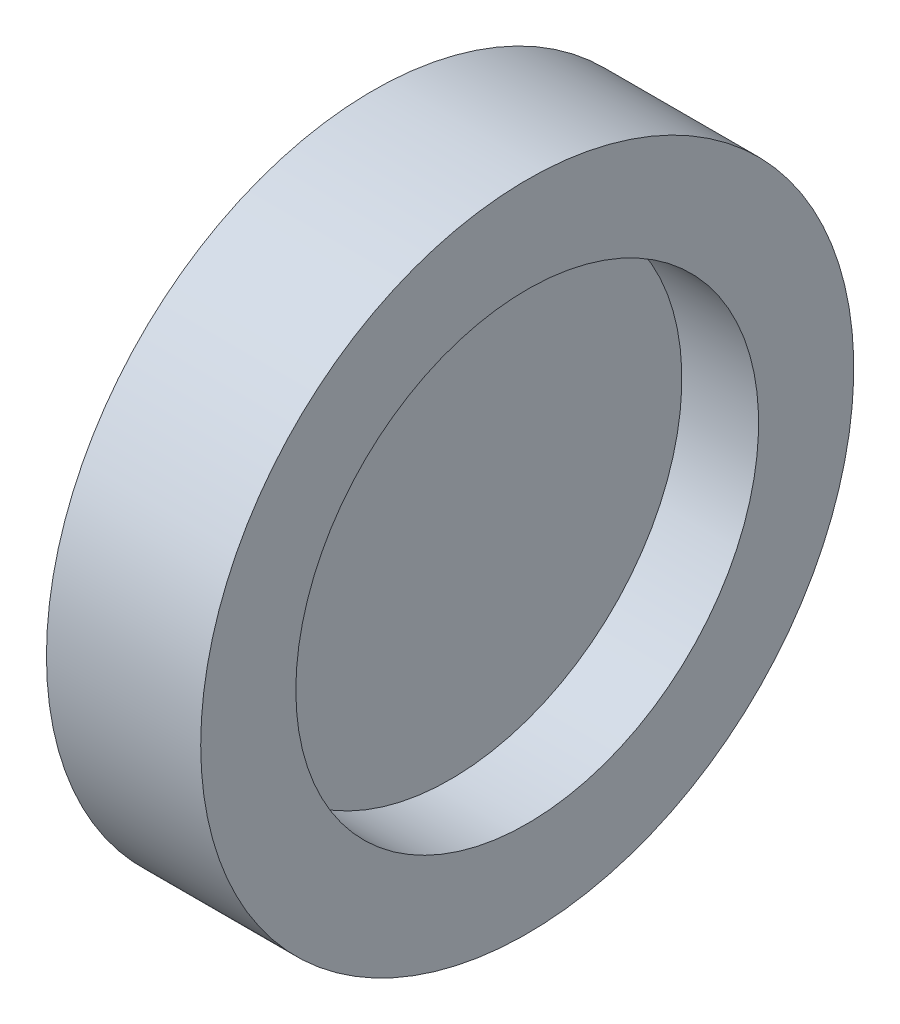
ISO-10303-21;
HEADER;
FILE_DESCRIPTION(('STEP AP214'),'2;1');
FILE_NAME('part.step','',(''),(''),'','','');
FILE_SCHEMA(('AUTOMOTIVE_DESIGN { 1 0 10303 214 1 1 1 1 }'));
ENDSEC;
DATA;
#1=APPLICATION_CONTEXT('core data for automotive mechanical design processes');
#2=APPLICATION_PROTOCOL_DEFINITION('international standard','automotive_design',2000,#1);
#3=PRODUCT_CONTEXT('',#1,'mechanical');
#4=PRODUCT('Part','Part','',(#3));
#5=PRODUCT_RELATED_PRODUCT_CATEGORY('part','',(#4));
#6=PRODUCT_DEFINITION_FORMATION('','',#4);
#7=PRODUCT_DEFINITION_CONTEXT('part definition',#1,'design');
#8=PRODUCT_DEFINITION('design','',#6,#7);
#9=PRODUCT_DEFINITION_SHAPE('','',#8);
#10=(LENGTH_UNIT() NAMED_UNIT(*) SI_UNIT(.MILLI.,.METRE.));
#11=(NAMED_UNIT(*) PLANE_ANGLE_UNIT() SI_UNIT($,.RADIAN.));
#12=(NAMED_UNIT(*) SI_UNIT($,.STERADIAN.) SOLID_ANGLE_UNIT());
#13=UNCERTAINTY_MEASURE_WITH_UNIT(LENGTH_MEASURE(1.E-05),#10,'distance_accuracy_value','');
#14=(GEOMETRIC_REPRESENTATION_CONTEXT(3) GLOBAL_UNCERTAINTY_ASSIGNED_CONTEXT((#13)) GLOBAL_UNIT_ASSIGNED_CONTEXT((#10,
#11,#12)) REPRESENTATION_CONTEXT('',''));
#15=CARTESIAN_POINT('',(0.,0.,0.));
#16=DIRECTION('',(0.,0.,1.));
#17=DIRECTION('',(1.,0.,0.));
#18=AXIS2_PLACEMENT_3D('',#15,#16,#17);
#19=CARTESIAN_POINT('',(0.0135000000000005,9.,0.));
#20=DIRECTION('',(-1.,0.,0.));
#21=DIRECTION('',(0.,0.,1.));
#22=AXIS2_PLACEMENT_3D('',#19,#20,#21);
#23=PLANE('',#22);
#24=CARTESIAN_POINT('',(0.0135000000000011,0.,0.));
#25=DIRECTION('',(-1.,0.,0.));
#26=DIRECTION('',(0.,0.,1.));
#27=AXIS2_PLACEMENT_3D('',#24,#25,#26);
#28=CIRCLE('',#27,9.);
#29=CARTESIAN_POINT('',(0.0135000000000011,0.,9.));
#30=VERTEX_POINT('',#29);
#31=EDGE_CURVE('E10',#30,#30,#28,.T.);
#32=ORIENTED_EDGE('',*,*,#31,.F.);
#33=EDGE_LOOP('',(#32));
#34=FACE_BOUND('',#33,.T.);
#35=ADVANCED_FACE('F37',(#34),#23,.F.);
#36=CARTESIAN_POINT('',(-1.61421241885762,0.,0.));
#37=DIRECTION('',(-1.,0.,0.));
#38=DIRECTION('',(0.,0.,1.));
#39=AXIS2_PLACEMENT_3D('',#36,#37,#38);
#40=CYLINDRICAL_SURFACE('',#39,9.);
#41=CARTESIAN_POINT('',(3.,0.,0.));
#42=DIRECTION('',(-1.,0.,0.));
#43=DIRECTION('',(0.,0.,1.));
#44=AXIS2_PLACEMENT_3D('',#41,#42,#43);
#45=CIRCLE('',#44,9.);
#46=CARTESIAN_POINT('',(3.,0.,9.));
#47=VERTEX_POINT('',#46);
#48=EDGE_CURVE('E60',#47,#47,#45,.T.);
#49=ORIENTED_EDGE('',*,*,#48,.F.);
#50=EDGE_LOOP('',(#49));
#51=FACE_BOUND('',#50,.T.);
#52=ORIENTED_EDGE('',*,*,#31,.T.);
#53=EDGE_LOOP('',(#52));
#54=FACE_BOUND('',#53,.T.);
#55=ADVANCED_FACE('F90',(#51,#54),#40,.F.);
#56=CARTESIAN_POINT('',(-3.,0.,0.));
#57=DIRECTION('',(-1.,0.,0.));
#58=DIRECTION('',(0.,0.,1.));
#59=AXIS2_PLACEMENT_3D('',#56,#57,#58);
#60=CIRCLE('',#59,9.);
#61=CARTESIAN_POINT('',(-3.,0.,9.));
#62=VERTEX_POINT('',#61);
#63=EDGE_CURVE('E64',#62,#62,#60,.T.);
#64=ORIENTED_EDGE('',*,*,#63,.T.);
#65=EDGE_LOOP('',(#64));
#66=FACE_BOUND('',#65,.T.);
#67=CARTESIAN_POINT('',(-0.0135000000000005,0.,0.));
#68=DIRECTION('',(1.,0.,0.));
#69=DIRECTION('',(0.,0.,-1.));
#70=AXIS2_PLACEMENT_3D('',#67,#68,#69);
#71=CIRCLE('',#70,9.);
#72=CARTESIAN_POINT('',(-0.0135000000000005,0.,-9.));
#73=VERTEX_POINT('',#72);
#74=EDGE_CURVE('E44',#73,#73,#71,.T.);
#75=ORIENTED_EDGE('',*,*,#74,.T.);
#76=EDGE_LOOP('',(#75));
#77=FACE_BOUND('',#76,.T.);
#78=ADVANCED_FACE('F69',(#66,#77),#40,.F.);
#79=CARTESIAN_POINT('',(-3.,9.,0.));
#80=DIRECTION('',(1.,0.,0.));
#81=DIRECTION('',(0.,0.,-1.));
#82=AXIS2_PLACEMENT_3D('',#79,#80,#81);
#83=PLANE('',#82);
#84=ORIENTED_EDGE('',*,*,#63,.F.);
#85=EDGE_LOOP('',(#84));
#86=FACE_BOUND('',#85,.T.);
#87=CARTESIAN_POINT('',(-3.,0.,0.));
#88=DIRECTION('',(-1.,0.,0.));
#89=DIRECTION('',(0.,0.,1.));
#90=AXIS2_PLACEMENT_3D('',#87,#88,#89);
#91=CIRCLE('',#90,12.7);
#92=CARTESIAN_POINT('',(-3.,0.,12.7));
#93=VERTEX_POINT('',#92);
#94=EDGE_CURVE('E49',#93,#93,#91,.T.);
#95=ORIENTED_EDGE('',*,*,#94,.T.);
#96=EDGE_LOOP('',(#95));
#97=FACE_BOUND('',#96,.T.);
#98=ADVANCED_FACE('F71',(#86,#97),#83,.F.);
#99=CARTESIAN_POINT('',(-1.61421241885762,0.,0.));
#100=DIRECTION('',(-1.,0.,0.));
#101=DIRECTION('',(0.,0.,1.));
#102=AXIS2_PLACEMENT_3D('',#99,#100,#101);
#103=CYLINDRICAL_SURFACE('',#102,12.7);
#104=ORIENTED_EDGE('',*,*,#94,.F.);
#105=EDGE_LOOP('',(#104));
#106=FACE_BOUND('',#105,.T.);
#107=CARTESIAN_POINT('',(3.,0.,0.));
#108=DIRECTION('',(-1.,0.,0.));
#109=DIRECTION('',(0.,0.,1.));
#110=AXIS2_PLACEMENT_3D('',#107,#108,#109);
#111=CIRCLE('',#110,12.7);
#112=CARTESIAN_POINT('',(3.,0.,12.7));
#113=VERTEX_POINT('',#112);
#114=EDGE_CURVE('E54',#113,#113,#111,.T.);
#115=ORIENTED_EDGE('',*,*,#114,.T.);
#116=EDGE_LOOP('',(#115));
#117=FACE_BOUND('',#116,.T.);
#118=ADVANCED_FACE('F74',(#106,#117),#103,.T.);
#119=CARTESIAN_POINT('',(3.,12.7,0.));
#120=DIRECTION('',(-1.,0.,0.));
#121=DIRECTION('',(0.,0.,1.));
#122=AXIS2_PLACEMENT_3D('',#119,#120,#121);
#123=PLANE('',#122);
#124=ORIENTED_EDGE('',*,*,#114,.F.);
#125=EDGE_LOOP('',(#124));
#126=FACE_BOUND('',#125,.T.);
#127=ORIENTED_EDGE('',*,*,#48,.T.);
#128=EDGE_LOOP('',(#127));
#129=FACE_BOUND('',#128,.T.);
#130=ADVANCED_FACE('F80',(#126,#129),#123,.F.);
#131=CARTESIAN_POINT('',(-0.0135000000000005,9.,0.));
#132=DIRECTION('',(1.,0.,0.));
#133=DIRECTION('',(0.,0.,-1.));
#134=AXIS2_PLACEMENT_3D('',#131,#132,#133);
#135=PLANE('',#134);
#136=ORIENTED_EDGE('',*,*,#74,.F.);
#137=EDGE_LOOP('',(#136));
#138=FACE_BOUND('',#137,.T.);
#139=ADVANCED_FACE('F86',(#138),#135,.F.);
#140=CLOSED_SHELL('',(#35,#55,#78,#98,#118,#130,#139));
#141=MANIFOLD_SOLID_BREP('B2',#140);
#142=ADVANCED_BREP_SHAPE_REPRESENTATION('',(#18,#141),#14);
#143=SHAPE_DEFINITION_REPRESENTATION(#9,#142);
ENDSEC;
END-ISO-10303-21;
